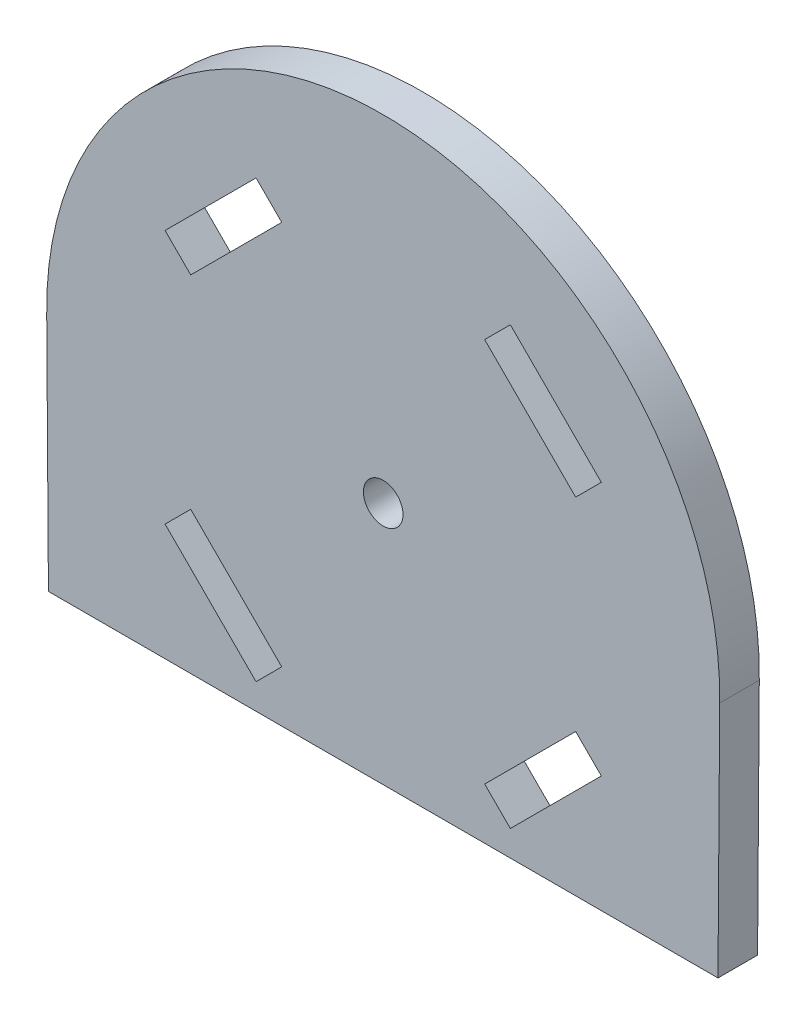
ISO-10303-21;
HEADER;
FILE_DESCRIPTION(('STEP AP214'),'2;1');
FILE_NAME('part.step','',(''),(''),'','','');
FILE_SCHEMA(('AUTOMOTIVE_DESIGN { 1 0 10303 214 1 1 1 1 }'));
ENDSEC;
DATA;
#1=APPLICATION_CONTEXT('core data for automotive mechanical design processes');
#2=APPLICATION_PROTOCOL_DEFINITION('international standard','automotive_design',2000,#1);
#3=PRODUCT_CONTEXT('',#1,'mechanical');
#4=PRODUCT('Part','Part','',(#3));
#5=PRODUCT_RELATED_PRODUCT_CATEGORY('part','',(#4));
#6=PRODUCT_DEFINITION_FORMATION('','',#4);
#7=PRODUCT_DEFINITION_CONTEXT('part definition',#1,'design');
#8=PRODUCT_DEFINITION('design','',#6,#7);
#9=PRODUCT_DEFINITION_SHAPE('','',#8);
#10=(LENGTH_UNIT() NAMED_UNIT(*) SI_UNIT(.MILLI.,.METRE.));
#11=(NAMED_UNIT(*) PLANE_ANGLE_UNIT() SI_UNIT($,.RADIAN.));
#12=(NAMED_UNIT(*) SI_UNIT($,.STERADIAN.) SOLID_ANGLE_UNIT());
#13=UNCERTAINTY_MEASURE_WITH_UNIT(LENGTH_MEASURE(1.E-05),#10,'distance_accuracy_value','');
#14=(GEOMETRIC_REPRESENTATION_CONTEXT(3) GLOBAL_UNCERTAINTY_ASSIGNED_CONTEXT((#13)) GLOBAL_UNIT_ASSIGNED_CONTEXT((#10,
#11,#12)) REPRESENTATION_CONTEXT('',''));
#15=CARTESIAN_POINT('',(0.,0.,0.));
#16=DIRECTION('',(0.,0.,1.));
#17=DIRECTION('',(1.,0.,0.));
#18=AXIS2_PLACEMENT_3D('',#15,#16,#17);
#19=CARTESIAN_POINT('',(72.0767167999961,45.7353085439818,6.));
#20=DIRECTION('',(0.,0.,1.));
#21=DIRECTION('',(1.,0.,0.));
#22=AXIS2_PLACEMENT_3D('',#19,#20,#21);
#23=PLANE('',#22);
#24=DIRECTION('',(-0.707106781186547,0.707106781186548,0.));
#25=VECTOR('',#24,1.);
#26=CARTESIAN_POINT('',(91.3453765873305,12.6780665235102,6.));
#27=LINE('',#26,#25);
#28=CARTESIAN_POINT('',(91.3453765873305,12.6780665235102,6.));
#29=VERTEX_POINT('',#28);
#30=CARTESIAN_POINT('',(87.4562892908038,16.5671538200368,6.));
#31=VERTEX_POINT('',#30);
#32=EDGE_CURVE('E349',#29,#31,#27,.T.);
#33=ORIENTED_EDGE('',*,*,#32,.T.);
#34=DIRECTION('',(0.707106781186594,0.707106781186501,0.));
#35=VECTOR('',#34,1.);
#36=CARTESIAN_POINT('',(87.4562892908038,16.5671538200368,6.));
#37=LINE('',#36,#35);
#38=CARTESIAN_POINT('',(101.244871523942,30.3557360531741,6.));
#39=VERTEX_POINT('',#38);
#40=EDGE_CURVE('E353',#31,#39,#37,.T.);
#41=ORIENTED_EDGE('',*,*,#40,.T.);
#42=DIRECTION('',(0.707106781186548,-0.707106781186547,0.));
#43=VECTOR('',#42,1.);
#44=CARTESIAN_POINT('',(101.244871523942,30.3557360531741,6.));
#45=LINE('',#44,#43);
#46=CARTESIAN_POINT('',(105.133958820468,26.4666487566483,6.));
#47=VERTEX_POINT('',#46);
#48=EDGE_CURVE('E358',#39,#47,#45,.T.);
#49=ORIENTED_EDGE('',*,*,#48,.T.);
#50=DIRECTION('',(-0.707106781186524,-0.707106781186571,0.));
#51=VECTOR('',#50,1.);
#52=CARTESIAN_POINT('',(105.133958820468,26.4666487566483,6.));
#53=LINE('',#52,#51);
#54=EDGE_CURVE('E362',#47,#29,#53,.T.);
#55=ORIENTED_EDGE('',*,*,#54,.T.);
#56=EDGE_LOOP('',(#33,#41,#49,#55));
#57=FACE_BOUND('',#56,.T.);
#58=DIRECTION('',(-1.,0.,0.));
#59=VECTOR('',#58,1.);
#60=CARTESIAN_POINT('',(122.811628350131,8.7889792269844,6.));
#61=LINE('',#60,#59);
#62=CARTESIAN_POINT('',(122.811628350131,8.7889792269844,6.));
#63=VERTEX_POINT('',#62);
#64=CARTESIAN_POINT('',(21.3418052498596,8.78897922698622,6.));
#65=VERTEX_POINT('',#64);
#66=EDGE_CURVE('E486',#63,#65,#61,.T.);
#67=ORIENTED_EDGE('',*,*,#66,.F.);
#68=DIRECTION('',(0.00717477572590252,0.999974260965392,0.));
#69=VECTOR('',#68,1.);
#70=CARTESIAN_POINT('',(122.811628350131,8.7889792269844,6.));
#71=LINE('',#70,#69);
#72=CARTESIAN_POINT('',(123.071466104511,45.0035002564423,6.));
#73=VERTEX_POINT('',#72);
#74=EDGE_CURVE('E498',#63,#73,#71,.T.);
#75=ORIENTED_EDGE('',*,*,#74,.T.);
#76=CARTESIAN_POINT('',(72.0767167999961,45.7353085439818,6.));
#77=DIRECTION('',(0.,0.,1.));
#78=DIRECTION('',(1.,0.,0.));
#79=AXIS2_PLACEMENT_3D('',#76,#77,#78);
#80=CIRCLE('',#79,51.0000000000005);
#81=CARTESIAN_POINT('',(21.0819674954824,45.0035002563497,6.));
#82=VERTEX_POINT('',#81);
#83=EDGE_CURVE('E495',#73,#82,#80,.T.);
#84=ORIENTED_EDGE('',*,*,#83,.T.);
#85=DIRECTION('',(-0.00717477572583473,0.999974260965393,0.));
#86=VECTOR('',#85,1.);
#87=CARTESIAN_POINT('',(21.3418052498596,8.78897922698622,6.));
#88=LINE('',#87,#86);
#89=EDGE_CURVE('E490',#65,#82,#88,.T.);
#90=ORIENTED_EDGE('',*,*,#89,.F.);
#91=EDGE_LOOP('',(#67,#75,#84,#90));
#92=FACE_BOUND('',#91,.T.);
#93=DIRECTION('',(0.707106781186713,0.707106781186382,0.));
#94=VECTOR('',#93,1.);
#95=CARTESIAN_POINT('',(39.0194747795244,26.4666487566483,6.));
#96=LINE('',#95,#94);
#97=CARTESIAN_POINT('',(39.0194747795244,26.4666487566483,6.));
#98=VERTEX_POINT('',#97);
#99=CARTESIAN_POINT('',(42.908562076052,30.3557360531741,6.));
#100=VERTEX_POINT('',#99);
#101=EDGE_CURVE('E455',#98,#100,#96,.T.);
#102=ORIENTED_EDGE('',*,*,#101,.T.);
#103=DIRECTION('',(0.707106781186547,-0.707106781186548,0.));
#104=VECTOR('',#103,1.);
#105=CARTESIAN_POINT('',(42.908562076052,30.3557360531741,6.));
#106=LINE('',#105,#104);
#107=CARTESIAN_POINT('',(56.6971443091893,16.5671538200368,6.));
#108=VERTEX_POINT('',#107);
#109=EDGE_CURVE('E442',#100,#108,#106,.T.);
#110=ORIENTED_EDGE('',*,*,#109,.T.);
#111=DIRECTION('',(-0.707106781186465,-0.707106781186631,0.));
#112=VECTOR('',#111,1.);
#113=CARTESIAN_POINT('',(56.6971443091893,16.5671538200368,6.));
#114=LINE('',#113,#112);
#115=CARTESIAN_POINT('',(52.8080570126635,12.6780665235102,6.));
#116=VERTEX_POINT('',#115);
#117=EDGE_CURVE('E446',#108,#116,#114,.T.);
#118=ORIENTED_EDGE('',*,*,#117,.T.);
#119=DIRECTION('',(-0.707106781186571,0.707106781186524,0.));
#120=VECTOR('',#119,1.);
#121=CARTESIAN_POINT('',(52.8080570126635,12.6780665235102,6.));
#122=LINE('',#121,#120);
#123=EDGE_CURVE('E451',#116,#98,#122,.T.);
#124=ORIENTED_EDGE('',*,*,#123,.T.);
#125=EDGE_LOOP('',(#102,#110,#118,#124));
#126=FACE_BOUND('',#125,.T.);
#127=CARTESIAN_POINT('',(72.0767167999961,45.7353085439818,6.));
#128=DIRECTION('',(0.,0.,1.));
#129=DIRECTION('',(1.,0.,0.));
#130=AXIS2_PLACEMENT_3D('',#127,#128,#129);
#131=CIRCLE('',#130,3.);
#132=CARTESIAN_POINT('',(75.0767167999961,45.7353085439818,6.));
#133=VERTEX_POINT('',#132);
#134=EDGE_CURVE('E434',#133,#133,#131,.T.);
#135=ORIENTED_EDGE('',*,*,#134,.F.);
#136=EDGE_LOOP('',(#135));
#137=FACE_BOUND('',#136,.T.);
#138=DIRECTION('',(-0.707106781186547,0.707106781186548,0.));
#139=VECTOR('',#138,1.);
#140=CARTESIAN_POINT('',(56.6971443091893,74.9034632679268,6.));
#141=LINE('',#140,#139);
#142=CARTESIAN_POINT('',(56.6971443091893,74.9034632679268,6.));
#143=VERTEX_POINT('',#142);
#144=CARTESIAN_POINT('',(52.8080570126635,78.7925505644526,6.));
#145=VERTEX_POINT('',#144);
#146=EDGE_CURVE('E396',#143,#145,#141,.T.);
#147=ORIENTED_EDGE('',*,*,#146,.F.);
#148=DIRECTION('',(0.707106781186501,0.707106781186594,0.));
#149=VECTOR('',#148,1.);
#150=CARTESIAN_POINT('',(42.908562076052,61.1148810347887,6.));
#151=LINE('',#150,#149);
#152=CARTESIAN_POINT('',(42.908562076052,61.1148810347887,6.));
#153=VERTEX_POINT('',#152);
#154=EDGE_CURVE('E393',#153,#143,#151,.T.);
#155=ORIENTED_EDGE('',*,*,#154,.F.);
#156=DIRECTION('',(0.707106781186549,-0.707106781186546,0.));
#157=VECTOR('',#156,1.);
#158=CARTESIAN_POINT('',(39.0194747795253,65.0039683313153,6.));
#159=LINE('',#158,#157);
#160=CARTESIAN_POINT('',(39.0194747795253,65.0039683313153,6.));
#161=VERTEX_POINT('',#160);
#162=EDGE_CURVE('E404',#161,#153,#159,.T.);
#163=ORIENTED_EDGE('',*,*,#162,.F.);
#164=DIRECTION('',(-0.707106781186571,-0.707106781186524,0.));
#165=VECTOR('',#164,1.);
#166=CARTESIAN_POINT('',(52.8080570126635,78.7925505644526,6.));
#167=LINE('',#166,#165);
#168=EDGE_CURVE('E400',#145,#161,#167,.T.);
#169=ORIENTED_EDGE('',*,*,#168,.F.);
#170=EDGE_LOOP('',(#147,#155,#163,#169));
#171=FACE_BOUND('',#170,.T.);
#172=DIRECTION('',(0.707106781186466,0.707106781186629,0.));
#173=VECTOR('',#172,1.);
#174=CARTESIAN_POINT('',(101.244871523942,61.1148810347887,6.));
#175=LINE('',#174,#173);
#176=CARTESIAN_POINT('',(101.244871523942,61.1148810347887,6.));
#177=VERTEX_POINT('',#176);
#178=CARTESIAN_POINT('',(105.133958820468,65.0039683313153,6.));
#179=VERTEX_POINT('',#178);
#180=EDGE_CURVE('E308',#177,#179,#175,.T.);
#181=ORIENTED_EDGE('',*,*,#180,.F.);
#182=DIRECTION('',(0.707106781186594,-0.707106781186501,0.));
#183=VECTOR('',#182,1.);
#184=CARTESIAN_POINT('',(87.4562892908029,74.9034632679268,6.));
#185=LINE('',#184,#183);
#186=CARTESIAN_POINT('',(87.4562892908029,74.9034632679268,6.));
#187=VERTEX_POINT('',#186);
#188=EDGE_CURVE('E299',#187,#177,#185,.T.);
#189=ORIENTED_EDGE('',*,*,#188,.F.);
#190=DIRECTION('',(-0.707106781186713,-0.707106781186382,0.));
#191=VECTOR('',#190,1.);
#192=CARTESIAN_POINT('',(91.3453765873305,78.7925505644526,6.));
#193=LINE('',#192,#191);
#194=CARTESIAN_POINT('',(91.3453765873305,78.7925505644526,6.));
#195=VERTEX_POINT('',#194);
#196=EDGE_CURVE('E326',#195,#187,#193,.T.);
#197=ORIENTED_EDGE('',*,*,#196,.F.);
#198=DIRECTION('',(-0.707106781186547,0.707106781186547,0.));
#199=VECTOR('',#198,1.);
#200=CARTESIAN_POINT('',(105.133958820468,65.0039683313153,6.));
#201=LINE('',#200,#199);
#202=EDGE_CURVE('E322',#179,#195,#201,.T.);
#203=ORIENTED_EDGE('',*,*,#202,.F.);
#204=EDGE_LOOP('',(#181,#189,#197,#203));
#205=FACE_BOUND('',#204,.T.);
#206=ADVANCED_FACE('F162',(#57,#92,#126,#137,#171,#205),#23,.T.);
#207=CARTESIAN_POINT('',(72.0767167999961,45.7353085439818,0.));
#208=DIRECTION('',(0.,0.,1.));
#209=DIRECTION('',(1.,0.,0.));
#210=AXIS2_PLACEMENT_3D('',#207,#208,#209);
#211=PLANE('',#210);
#212=DIRECTION('',(0.707106781186547,0.707106781186547,0.));
#213=VECTOR('',#212,1.);
#214=CARTESIAN_POINT('',(49.8028531926206,68.0091721513582,0.));
#215=LINE('',#214,#213);
#216=CARTESIAN_POINT('',(42.908562076052,61.1148810347887,0.));
#217=VERTEX_POINT('',#216);
#218=CARTESIAN_POINT('',(56.6971443091893,74.9034632679268,0.));
#219=VERTEX_POINT('',#218);
#220=EDGE_CURVE('E383',#217,#219,#215,.T.);
#221=ORIENTED_EDGE('',*,*,#220,.T.);
#222=DIRECTION('',(-0.707106781186547,0.707106781186548,0.));
#223=VECTOR('',#222,1.);
#224=CARTESIAN_POINT('',(56.6971443091893,74.9034632679268,0.));
#225=LINE('',#224,#223);
#226=CARTESIAN_POINT('',(52.8080570126635,78.7925505644526,0.));
#227=VERTEX_POINT('',#226);
#228=EDGE_CURVE('E411',#219,#227,#225,.T.);
#229=ORIENTED_EDGE('',*,*,#228,.T.);
#230=DIRECTION('',(-0.707106781186571,-0.707106781186524,0.));
#231=VECTOR('',#230,1.);
#232=CARTESIAN_POINT('',(52.8080570126635,78.7925505644526,0.));
#233=LINE('',#232,#231);
#234=CARTESIAN_POINT('',(39.0194747795253,65.0039683313153,0.));
#235=VERTEX_POINT('',#234);
#236=EDGE_CURVE('E415',#227,#235,#233,.T.);
#237=ORIENTED_EDGE('',*,*,#236,.T.);
#238=DIRECTION('',(0.707106781186549,-0.707106781186546,0.));
#239=VECTOR('',#238,1.);
#240=CARTESIAN_POINT('',(39.0194747795253,65.0039683313153,0.));
#241=LINE('',#240,#239);
#242=EDGE_CURVE('E397',#235,#217,#241,.T.);
#243=ORIENTED_EDGE('',*,*,#242,.T.);
#244=EDGE_LOOP('',(#221,#229,#237,#243));
#245=FACE_BOUND('',#244,.T.);
#246=DIRECTION('',(0.707106781186547,-0.707106781186547,0.));
#247=VECTOR('',#246,1.);
#248=CARTESIAN_POINT('',(49.8028531926206,23.4614449366055,0.));
#249=LINE('',#248,#247);
#250=CARTESIAN_POINT('',(42.908562076052,30.3557360531741,0.));
#251=VERTEX_POINT('',#250);
#252=CARTESIAN_POINT('',(56.6971443091893,16.5671538200368,0.));
#253=VERTEX_POINT('',#252);
#254=EDGE_CURVE('E438',#251,#253,#249,.T.);
#255=ORIENTED_EDGE('',*,*,#254,.F.);
#256=DIRECTION('',(0.707106781186713,0.707106781186382,0.));
#257=VECTOR('',#256,1.);
#258=CARTESIAN_POINT('',(39.0194747795244,26.4666487566483,0.));
#259=LINE('',#258,#257);
#260=CARTESIAN_POINT('',(39.0194747795244,26.4666487566483,0.));
#261=VERTEX_POINT('',#260);
#262=EDGE_CURVE('E447',#261,#251,#259,.T.);
#263=ORIENTED_EDGE('',*,*,#262,.F.);
#264=DIRECTION('',(-0.707106781186571,0.707106781186524,0.));
#265=VECTOR('',#264,1.);
#266=CARTESIAN_POINT('',(52.8080570126635,12.6780665235102,0.));
#267=LINE('',#266,#265);
#268=CARTESIAN_POINT('',(52.8080570126635,12.6780665235102,0.));
#269=VERTEX_POINT('',#268);
#270=EDGE_CURVE('E467',#269,#261,#267,.T.);
#271=ORIENTED_EDGE('',*,*,#270,.F.);
#272=DIRECTION('',(-0.707106781186465,-0.707106781186631,0.));
#273=VECTOR('',#272,1.);
#274=CARTESIAN_POINT('',(56.6971443091893,16.5671538200368,0.));
#275=LINE('',#274,#273);
#276=EDGE_CURVE('E463',#253,#269,#275,.T.);
#277=ORIENTED_EDGE('',*,*,#276,.F.);
#278=EDGE_LOOP('',(#255,#263,#271,#277));
#279=FACE_BOUND('',#278,.T.);
#280=DIRECTION('',(-1.,0.,0.));
#281=VECTOR('',#280,1.);
#282=CARTESIAN_POINT('',(122.811628350131,8.7889792269844,0.));
#283=LINE('',#282,#281);
#284=CARTESIAN_POINT('',(122.811628350131,8.7889792269844,0.));
#285=VERTEX_POINT('',#284);
#286=CARTESIAN_POINT('',(21.3418052498596,8.78897922698622,0.));
#287=VERTEX_POINT('',#286);
#288=EDGE_CURVE('E477',#285,#287,#283,.T.);
#289=ORIENTED_EDGE('',*,*,#288,.T.);
#290=DIRECTION('',(-0.00717477572583473,0.999974260965393,0.));
#291=VECTOR('',#290,1.);
#292=CARTESIAN_POINT('',(21.3418052498596,8.78897922698622,0.));
#293=LINE('',#292,#291);
#294=CARTESIAN_POINT('',(21.0819674954824,45.0035002563497,0.));
#295=VERTEX_POINT('',#294);
#296=EDGE_CURVE('E504',#287,#295,#293,.T.);
#297=ORIENTED_EDGE('',*,*,#296,.T.);
#298=CARTESIAN_POINT('',(72.0767167999961,45.7353085439818,0.));
#299=DIRECTION('',(0.,0.,1.));
#300=DIRECTION('',(1.,0.,0.));
#301=AXIS2_PLACEMENT_3D('',#298,#299,#300);
#302=CIRCLE('',#301,51.0000000000005);
#303=CARTESIAN_POINT('',(123.071466104511,45.0035002564423,0.));
#304=VERTEX_POINT('',#303);
#305=EDGE_CURVE('E508',#304,#295,#302,.T.);
#306=ORIENTED_EDGE('',*,*,#305,.F.);
#307=DIRECTION('',(0.00717477572590252,0.999974260965392,0.));
#308=VECTOR('',#307,1.);
#309=CARTESIAN_POINT('',(122.811628350131,8.7889792269844,0.));
#310=LINE('',#309,#308);
#311=EDGE_CURVE('E491',#285,#304,#310,.T.);
#312=ORIENTED_EDGE('',*,*,#311,.F.);
#313=EDGE_LOOP('',(#289,#297,#306,#312));
#314=FACE_BOUND('',#313,.T.);
#315=CARTESIAN_POINT('',(72.0767167999961,45.7353085439818,0.));
#316=DIRECTION('',(0.,0.,1.));
#317=DIRECTION('',(1.,0.,0.));
#318=AXIS2_PLACEMENT_3D('',#315,#316,#317);
#319=CIRCLE('',#318,3.);
#320=CARTESIAN_POINT('',(75.0767167999961,45.7353085439818,0.));
#321=VERTEX_POINT('',#320);
#322=EDGE_CURVE('E433',#321,#321,#319,.T.);
#323=ORIENTED_EDGE('',*,*,#322,.T.);
#324=EDGE_LOOP('',(#323));
#325=FACE_BOUND('',#324,.T.);
#326=DIRECTION('',(0.707106781186548,0.707106781186547,0.));
#327=VECTOR('',#326,1.);
#328=CARTESIAN_POINT('',(94.3505804073734,23.4614449366055,0.));
#329=LINE('',#328,#327);
#330=CARTESIAN_POINT('',(87.4562892908047,16.5671538200368,0.));
#331=VERTEX_POINT('',#330);
#332=CARTESIAN_POINT('',(101.244871523942,30.3557360531741,0.));
#333=VERTEX_POINT('',#332);
#334=EDGE_CURVE('E369',#331,#333,#329,.T.);
#335=ORIENTED_EDGE('',*,*,#334,.F.);
#336=DIRECTION('',(-0.707106781186547,0.707106781186548,0.));
#337=VECTOR('',#336,1.);
#338=CARTESIAN_POINT('',(91.3453765873305,12.6780665235102,0.));
#339=LINE('',#338,#337);
#340=CARTESIAN_POINT('',(91.3453765873305,12.6780665235102,0.));
#341=VERTEX_POINT('',#340);
#342=EDGE_CURVE('E318',#341,#331,#339,.T.);
#343=ORIENTED_EDGE('',*,*,#342,.F.);
#344=DIRECTION('',(-0.707106781186524,-0.707106781186571,0.));
#345=VECTOR('',#344,1.);
#346=CARTESIAN_POINT('',(105.133958820468,26.4666487566483,0.));
#347=LINE('',#346,#345);
#348=CARTESIAN_POINT('',(105.133958820468,26.4666487566483,0.));
#349=VERTEX_POINT('',#348);
#350=EDGE_CURVE('E354',#349,#341,#347,.T.);
#351=ORIENTED_EDGE('',*,*,#350,.F.);
#352=DIRECTION('',(0.707106781186548,-0.707106781186547,0.));
#353=VECTOR('',#352,1.);
#354=CARTESIAN_POINT('',(101.244871523942,30.3557360531741,0.));
#355=LINE('',#354,#353);
#356=EDGE_CURVE('E373',#333,#349,#355,.T.);
#357=ORIENTED_EDGE('',*,*,#356,.F.);
#358=EDGE_LOOP('',(#335,#343,#351,#357));
#359=FACE_BOUND('',#358,.T.);
#360=DIRECTION('',(0.707106781186549,-0.707106781186546,0.));
#361=VECTOR('',#360,1.);
#362=CARTESIAN_POINT('',(94.3505804073725,68.0091721513582,0.));
#363=LINE('',#362,#361);
#364=CARTESIAN_POINT('',(87.4562892908029,74.9034632679268,0.));
#365=VERTEX_POINT('',#364);
#366=CARTESIAN_POINT('',(101.244871523942,61.1148810347887,0.));
#367=VERTEX_POINT('',#366);
#368=EDGE_CURVE('E331',#365,#367,#363,.T.);
#369=ORIENTED_EDGE('',*,*,#368,.T.);
#370=DIRECTION('',(0.707106781186466,0.707106781186629,0.));
#371=VECTOR('',#370,1.);
#372=CARTESIAN_POINT('',(101.244871523942,61.1148810347887,0.));
#373=LINE('',#372,#371);
#374=CARTESIAN_POINT('',(105.133958820468,65.0039683313153,0.));
#375=VERTEX_POINT('',#374);
#376=EDGE_CURVE('E315',#367,#375,#373,.T.);
#377=ORIENTED_EDGE('',*,*,#376,.T.);
#378=DIRECTION('',(-0.707106781186547,0.707106781186547,0.));
#379=VECTOR('',#378,1.);
#380=CARTESIAN_POINT('',(105.133958820468,65.0039683313153,0.));
#381=LINE('',#380,#379);
#382=CARTESIAN_POINT('',(91.3453765873305,78.7925505644526,0.));
#383=VERTEX_POINT('',#382);
#384=EDGE_CURVE('E336',#375,#383,#381,.T.);
#385=ORIENTED_EDGE('',*,*,#384,.T.);
#386=DIRECTION('',(-0.707106781186713,-0.707106781186382,0.));
#387=VECTOR('',#386,1.);
#388=CARTESIAN_POINT('',(91.3453765873305,78.7925505644526,0.));
#389=LINE('',#388,#387);
#390=EDGE_CURVE('E309',#383,#365,#389,.T.);
#391=ORIENTED_EDGE('',*,*,#390,.T.);
#392=EDGE_LOOP('',(#369,#377,#385,#391));
#393=FACE_BOUND('',#392,.T.);
#394=ADVANCED_FACE('F530',(#245,#279,#314,#325,#359,#393),#211,.F.);
#395=CARTESIAN_POINT('',(122.811628350131,8.7889792269844,6.));
#396=DIRECTION('',(0.,-1.,0.));
#397=DIRECTION('',(1.,0.,0.));
#398=AXIS2_PLACEMENT_3D('',#395,#396,#397);
#399=PLANE('',#398);
#400=ORIENTED_EDGE('',*,*,#288,.F.);
#401=DIRECTION('',(0.,0.,-1.));
#402=VECTOR('',#401,1.);
#403=CARTESIAN_POINT('',(122.811628350131,8.7889792269844,6.));
#404=LINE('',#403,#402);
#405=EDGE_CURVE('E12',#63,#285,#404,.T.);
#406=ORIENTED_EDGE('',*,*,#405,.F.);
#407=ORIENTED_EDGE('',*,*,#66,.T.);
#408=DIRECTION('',(0.,0.,-1.));
#409=VECTOR('',#408,1.);
#410=CARTESIAN_POINT('',(21.3418052498596,8.78897922698622,6.));
#411=LINE('',#410,#409);
#412=EDGE_CURVE('E166',#65,#287,#411,.T.);
#413=ORIENTED_EDGE('',*,*,#412,.T.);
#414=EDGE_LOOP('',(#400,#406,#407,#413));
#415=FACE_BOUND('',#414,.T.);
#416=ADVANCED_FACE('F164',(#415),#399,.T.);
#417=CARTESIAN_POINT('',(122.811628350131,8.7889792269844,6.));
#418=DIRECTION('',(-0.999974260965392,0.00717477572590251,0.));
#419=DIRECTION('',(-0.00717477572590252,-0.999974260965393,0.));
#420=AXIS2_PLACEMENT_3D('',#417,#418,#419);
#421=PLANE('',#420);
#422=ORIENTED_EDGE('',*,*,#311,.T.);
#423=DIRECTION('',(0.,0.,-1.));
#424=VECTOR('',#423,1.);
#425=CARTESIAN_POINT('',(123.071466104511,45.0035002564423,6.));
#426=LINE('',#425,#424);
#427=EDGE_CURVE('E172',#73,#304,#426,.T.);
#428=ORIENTED_EDGE('',*,*,#427,.F.);
#429=ORIENTED_EDGE('',*,*,#74,.F.);
#430=ORIENTED_EDGE('',*,*,#405,.T.);
#431=EDGE_LOOP('',(#422,#428,#429,#430));
#432=FACE_BOUND('',#431,.T.);
#433=ADVANCED_FACE('F534',(#432),#421,.F.);
#434=CARTESIAN_POINT('',(72.0767167999961,45.7353085439818,6.));
#435=DIRECTION('',(0.,0.,-1.));
#436=DIRECTION('',(-1.,0.,0.));
#437=AXIS2_PLACEMENT_3D('',#434,#435,#436);
#438=CYLINDRICAL_SURFACE('',#437,51.0000000000005);
#439=ORIENTED_EDGE('',*,*,#305,.T.);
#440=DIRECTION('',(0.,0.,-1.));
#441=VECTOR('',#440,1.);
#442=CARTESIAN_POINT('',(21.0819674954824,45.0035002563497,6.));
#443=LINE('',#442,#441);
#444=EDGE_CURVE('E516',#82,#295,#443,.T.);
#445=ORIENTED_EDGE('',*,*,#444,.F.);
#446=ORIENTED_EDGE('',*,*,#83,.F.);
#447=ORIENTED_EDGE('',*,*,#427,.T.);
#448=EDGE_LOOP('',(#439,#445,#446,#447));
#449=FACE_BOUND('',#448,.T.);
#450=ADVANCED_FACE('F538',(#449),#438,.T.);
#451=CARTESIAN_POINT('',(21.3418052498596,8.78897922698622,6.));
#452=DIRECTION('',(-0.999974260965393,-0.00717477572583473,0.));
#453=DIRECTION('',(0.00717477572583473,-0.999974260965393,0.));
#454=AXIS2_PLACEMENT_3D('',#451,#452,#453);
#455=PLANE('',#454);
#456=ORIENTED_EDGE('',*,*,#296,.F.);
#457=ORIENTED_EDGE('',*,*,#412,.F.);
#458=ORIENTED_EDGE('',*,*,#89,.T.);
#459=ORIENTED_EDGE('',*,*,#444,.T.);
#460=EDGE_LOOP('',(#456,#457,#458,#459));
#461=FACE_BOUND('',#460,.T.);
#462=ADVANCED_FACE('F526',(#461),#455,.T.);
#463=CARTESIAN_POINT('',(39.0194747795244,26.4666487566483,6.));
#464=DIRECTION('',(-0.707106781186382,0.707106781186713,0.));
#465=DIRECTION('',(-0.707106781186713,-0.707106781186382,0.));
#466=AXIS2_PLACEMENT_3D('',#463,#464,#465);
#467=PLANE('',#466);
#468=ORIENTED_EDGE('',*,*,#262,.T.);
#469=DIRECTION('',(0.,0.,-1.));
#470=VECTOR('',#469,1.);
#471=CARTESIAN_POINT('',(42.908562076052,30.3557360531741,6.));
#472=LINE('',#471,#470);
#473=EDGE_CURVE('E473',#100,#251,#472,.T.);
#474=ORIENTED_EDGE('',*,*,#473,.F.);
#475=ORIENTED_EDGE('',*,*,#101,.F.);
#476=DIRECTION('',(0.,0.,-1.));
#477=VECTOR('',#476,1.);
#478=CARTESIAN_POINT('',(39.0194747795244,26.4666487566483,6.));
#479=LINE('',#478,#477);
#480=EDGE_CURVE('E478',#98,#261,#479,.T.);
#481=ORIENTED_EDGE('',*,*,#480,.T.);
#482=EDGE_LOOP('',(#468,#474,#475,#481));
#483=FACE_BOUND('',#482,.T.);
#484=ADVANCED_FACE('F591',(#483),#467,.F.);
#485=CARTESIAN_POINT('',(52.8080570126635,12.6780665235102,6.));
#486=DIRECTION('',(-0.707106781186524,-0.707106781186571,0.));
#487=DIRECTION('',(0.707106781186571,-0.707106781186524,0.));
#488=AXIS2_PLACEMENT_3D('',#485,#486,#487);
#489=PLANE('',#488);
#490=ORIENTED_EDGE('',*,*,#270,.T.);
#491=ORIENTED_EDGE('',*,*,#480,.F.);
#492=ORIENTED_EDGE('',*,*,#123,.F.);
#493=DIRECTION('',(0.,0.,-1.));
#494=VECTOR('',#493,1.);
#495=CARTESIAN_POINT('',(52.8080570126635,12.6780665235102,6.));
#496=LINE('',#495,#494);
#497=EDGE_CURVE('E481',#116,#269,#496,.T.);
#498=ORIENTED_EDGE('',*,*,#497,.T.);
#499=EDGE_LOOP('',(#490,#491,#492,#498));
#500=FACE_BOUND('',#499,.T.);
#501=ADVANCED_FACE('F594',(#500),#489,.F.);
#502=CARTESIAN_POINT('',(56.6971443091893,16.5671538200368,6.));
#503=DIRECTION('',(0.70710678118663,-0.707106781186465,0.));
#504=DIRECTION('',(0.707106781186465,0.70710678118663,0.));
#505=AXIS2_PLACEMENT_3D('',#502,#503,#504);
#506=PLANE('',#505);
#507=ORIENTED_EDGE('',*,*,#276,.T.);
#508=ORIENTED_EDGE('',*,*,#497,.F.);
#509=ORIENTED_EDGE('',*,*,#117,.F.);
#510=DIRECTION('',(0.,0.,-1.));
#511=VECTOR('',#510,1.);
#512=CARTESIAN_POINT('',(56.6971443091893,16.5671538200368,6.));
#513=LINE('',#512,#511);
#514=EDGE_CURVE('E459',#108,#253,#513,.T.);
#515=ORIENTED_EDGE('',*,*,#514,.T.);
#516=EDGE_LOOP('',(#507,#508,#509,#515));
#517=FACE_BOUND('',#516,.T.);
#518=ADVANCED_FACE('F598',(#517),#506,.F.);
#519=CARTESIAN_POINT('',(49.8028531926206,23.4614449366055,6.));
#520=DIRECTION('',(0.707106781186548,0.707106781186548,0.));
#521=DIRECTION('',(-0.707106781186548,0.707106781186548,0.));
#522=AXIS2_PLACEMENT_3D('',#519,#520,#521);
#523=PLANE('',#522);
#524=ORIENTED_EDGE('',*,*,#254,.T.);
#525=ORIENTED_EDGE('',*,*,#514,.F.);
#526=ORIENTED_EDGE('',*,*,#109,.F.);
#527=ORIENTED_EDGE('',*,*,#473,.T.);
#528=EDGE_LOOP('',(#524,#525,#526,#527));
#529=FACE_BOUND('',#528,.T.);
#530=ADVANCED_FACE('F589',(#529),#523,.F.);
#531=CARTESIAN_POINT('',(72.0767167999961,45.7353085439818,6.));
#532=DIRECTION('',(0.,0.,-1.));
#533=DIRECTION('',(-1.,0.,0.));
#534=AXIS2_PLACEMENT_3D('',#531,#532,#533);
#535=CYLINDRICAL_SURFACE('',#534,3.);
#536=ORIENTED_EDGE('',*,*,#134,.T.);
#537=EDGE_LOOP('',(#536));
#538=FACE_BOUND('',#537,.T.);
#539=ORIENTED_EDGE('',*,*,#322,.F.);
#540=EDGE_LOOP('',(#539));
#541=FACE_BOUND('',#540,.T.);
#542=ADVANCED_FACE('F586',(#538,#541),#535,.F.);
#543=CARTESIAN_POINT('',(49.8028531926206,68.0091721513582,6.));
#544=DIRECTION('',(-0.707106781186548,0.707106781186548,0.));
#545=DIRECTION('',(-0.707106781186548,-0.707106781186548,0.));
#546=AXIS2_PLACEMENT_3D('',#543,#544,#545);
#547=PLANE('',#546);
#548=ORIENTED_EDGE('',*,*,#220,.F.);
#549=DIRECTION('',(0.,0.,-1.));
#550=VECTOR('',#549,1.);
#551=CARTESIAN_POINT('',(42.908562076052,61.1148810347887,6.));
#552=LINE('',#551,#550);
#553=EDGE_CURVE('E407',#153,#217,#552,.T.);
#554=ORIENTED_EDGE('',*,*,#553,.F.);
#555=ORIENTED_EDGE('',*,*,#154,.T.);
#556=DIRECTION('',(0.,0.,-1.));
#557=VECTOR('',#556,1.);
#558=CARTESIAN_POINT('',(56.6971443091893,74.9034632679268,6.));
#559=LINE('',#558,#557);
#560=EDGE_CURVE('E430',#143,#219,#559,.T.);
#561=ORIENTED_EDGE('',*,*,#560,.T.);
#562=EDGE_LOOP('',(#548,#554,#555,#561));
#563=FACE_BOUND('',#562,.T.);
#564=ADVANCED_FACE('F566',(#563),#547,.T.);
#565=CARTESIAN_POINT('',(56.6971443091893,74.9034632679268,6.));
#566=DIRECTION('',(-0.707106781186548,-0.707106781186547,0.));
#567=DIRECTION('',(0.707106781186547,-0.707106781186548,0.));
#568=AXIS2_PLACEMENT_3D('',#565,#566,#567);
#569=PLANE('',#568);
#570=ORIENTED_EDGE('',*,*,#228,.F.);
#571=ORIENTED_EDGE('',*,*,#560,.F.);
#572=ORIENTED_EDGE('',*,*,#146,.T.);
#573=DIRECTION('',(0.,0.,-1.));
#574=VECTOR('',#573,1.);
#575=CARTESIAN_POINT('',(52.8080570126635,78.7925505644526,6.));
#576=LINE('',#575,#574);
#577=EDGE_CURVE('E427',#145,#227,#576,.T.);
#578=ORIENTED_EDGE('',*,*,#577,.T.);
#579=EDGE_LOOP('',(#570,#571,#572,#578));
#580=FACE_BOUND('',#579,.T.);
#581=ADVANCED_FACE('F556',(#580),#569,.T.);
#582=CARTESIAN_POINT('',(52.8080570126635,78.7925505644526,6.));
#583=DIRECTION('',(0.707106781186524,-0.707106781186571,0.));
#584=DIRECTION('',(0.707106781186571,0.707106781186524,0.));
#585=AXIS2_PLACEMENT_3D('',#582,#583,#584);
#586=PLANE('',#585);
#587=ORIENTED_EDGE('',*,*,#236,.F.);
#588=ORIENTED_EDGE('',*,*,#577,.F.);
#589=ORIENTED_EDGE('',*,*,#168,.T.);
#590=DIRECTION('',(0.,0.,-1.));
#591=VECTOR('',#590,1.);
#592=CARTESIAN_POINT('',(39.0194747795253,65.0039683313153,6.));
#593=LINE('',#592,#591);
#594=EDGE_CURVE('E424',#161,#235,#593,.T.);
#595=ORIENTED_EDGE('',*,*,#594,.T.);
#596=EDGE_LOOP('',(#587,#588,#589,#595));
#597=FACE_BOUND('',#596,.T.);
#598=ADVANCED_FACE('F559',(#597),#586,.T.);
#599=CARTESIAN_POINT('',(39.0194747795253,65.0039683313153,6.));
#600=DIRECTION('',(0.707106781186546,0.707106781186549,0.));
#601=DIRECTION('',(-0.707106781186549,0.707106781186546,0.));
#602=AXIS2_PLACEMENT_3D('',#599,#600,#601);
#603=PLANE('',#602);
#604=ORIENTED_EDGE('',*,*,#242,.F.);
#605=ORIENTED_EDGE('',*,*,#594,.F.);
#606=ORIENTED_EDGE('',*,*,#162,.T.);
#607=ORIENTED_EDGE('',*,*,#553,.T.);
#608=EDGE_LOOP('',(#604,#605,#606,#607));
#609=FACE_BOUND('',#608,.T.);
#610=ADVANCED_FACE('F568',(#609),#603,.T.);
#611=CARTESIAN_POINT('',(91.3453765873305,12.6780665235102,6.));
#612=DIRECTION('',(-0.707106781186548,-0.707106781186547,0.));
#613=DIRECTION('',(0.707106781186547,-0.707106781186548,0.));
#614=AXIS2_PLACEMENT_3D('',#611,#612,#613);
#615=PLANE('',#614);
#616=ORIENTED_EDGE('',*,*,#342,.T.);
#617=DIRECTION('',(0.,0.,-1.));
#618=VECTOR('',#617,1.);
#619=CARTESIAN_POINT('',(87.4562892908038,16.5671538200368,6.));
#620=LINE('',#619,#618);
#621=EDGE_CURVE('E366',#31,#331,#620,.T.);
#622=ORIENTED_EDGE('',*,*,#621,.F.);
#623=ORIENTED_EDGE('',*,*,#32,.F.);
#624=DIRECTION('',(0.,0.,-1.));
#625=VECTOR('',#624,1.);
#626=CARTESIAN_POINT('',(91.3453765873305,12.6780665235102,6.));
#627=LINE('',#626,#625);
#628=EDGE_CURVE('E380',#29,#341,#627,.T.);
#629=ORIENTED_EDGE('',*,*,#628,.T.);
#630=EDGE_LOOP('',(#616,#622,#623,#629));
#631=FACE_BOUND('',#630,.T.);
#632=ADVANCED_FACE('F570',(#631),#615,.F.);
#633=CARTESIAN_POINT('',(105.133958820468,26.4666487566483,6.));
#634=DIRECTION('',(0.707106781186571,-0.707106781186524,0.));
#635=DIRECTION('',(0.707106781186524,0.707106781186571,0.));
#636=AXIS2_PLACEMENT_3D('',#633,#634,#635);
#637=PLANE('',#636);
#638=ORIENTED_EDGE('',*,*,#350,.T.);
#639=ORIENTED_EDGE('',*,*,#628,.F.);
#640=ORIENTED_EDGE('',*,*,#54,.F.);
#641=DIRECTION('',(0.,0.,-1.));
#642=VECTOR('',#641,1.);
#643=CARTESIAN_POINT('',(105.133958820468,26.4666487566483,6.));
#644=LINE('',#643,#642);
#645=EDGE_CURVE('E384',#47,#349,#644,.T.);
#646=ORIENTED_EDGE('',*,*,#645,.T.);
#647=EDGE_LOOP('',(#638,#639,#640,#646));
#648=FACE_BOUND('',#647,.T.);
#649=ADVANCED_FACE('F576',(#648),#637,.F.);
#650=CARTESIAN_POINT('',(101.244871523942,30.3557360531741,6.));
#651=DIRECTION('',(0.707106781186547,0.707106781186548,0.));
#652=DIRECTION('',(-0.707106781186548,0.707106781186547,0.));
#653=AXIS2_PLACEMENT_3D('',#650,#651,#652);
#654=PLANE('',#653);
#655=ORIENTED_EDGE('',*,*,#356,.T.);
#656=ORIENTED_EDGE('',*,*,#645,.F.);
#657=ORIENTED_EDGE('',*,*,#48,.F.);
#658=DIRECTION('',(0.,0.,-1.));
#659=VECTOR('',#658,1.);
#660=CARTESIAN_POINT('',(101.244871523942,30.3557360531741,6.));
#661=LINE('',#660,#659);
#662=EDGE_CURVE('E387',#39,#333,#661,.T.);
#663=ORIENTED_EDGE('',*,*,#662,.T.);
#664=EDGE_LOOP('',(#655,#656,#657,#663));
#665=FACE_BOUND('',#664,.T.);
#666=ADVANCED_FACE('F667',(#665),#654,.F.);
#667=CARTESIAN_POINT('',(94.3505804073734,23.4614449366055,6.));
#668=DIRECTION('',(-0.707106781186547,0.707106781186548,0.));
#669=DIRECTION('',(-0.707106781186548,-0.707106781186547,0.));
#670=AXIS2_PLACEMENT_3D('',#667,#668,#669);
#671=PLANE('',#670);
#672=ORIENTED_EDGE('',*,*,#334,.T.);
#673=ORIENTED_EDGE('',*,*,#662,.F.);
#674=ORIENTED_EDGE('',*,*,#40,.F.);
#675=ORIENTED_EDGE('',*,*,#621,.T.);
#676=EDGE_LOOP('',(#672,#673,#674,#675));
#677=FACE_BOUND('',#676,.T.);
#678=ADVANCED_FACE('F677',(#677),#671,.F.);
#679=CARTESIAN_POINT('',(94.3505804073725,68.0091721513582,6.));
#680=DIRECTION('',(0.707106781186546,0.707106781186548,0.));
#681=DIRECTION('',(-0.707106781186549,0.707106781186546,0.));
#682=AXIS2_PLACEMENT_3D('',#679,#680,#681);
#683=PLANE('',#682);
#684=ORIENTED_EDGE('',*,*,#368,.F.);
#685=DIRECTION('',(0.,0.,-1.));
#686=VECTOR('',#685,1.);
#687=CARTESIAN_POINT('',(87.4562892908029,74.9034632679268,6.));
#688=LINE('',#687,#686);
#689=EDGE_CURVE('E185',#187,#365,#688,.T.);
#690=ORIENTED_EDGE('',*,*,#689,.F.);
#691=ORIENTED_EDGE('',*,*,#188,.T.);
#692=DIRECTION('',(0.,0.,-1.));
#693=VECTOR('',#692,1.);
#694=CARTESIAN_POINT('',(101.244871523942,61.1148810347887,6.));
#695=LINE('',#694,#693);
#696=EDGE_CURVE('E302',#177,#367,#695,.T.);
#697=ORIENTED_EDGE('',*,*,#696,.T.);
#698=EDGE_LOOP('',(#684,#690,#691,#697));
#699=FACE_BOUND('',#698,.T.);
#700=ADVANCED_FACE('F301',(#699),#683,.T.);
#701=CARTESIAN_POINT('',(101.244871523942,61.1148810347887,6.));
#702=DIRECTION('',(-0.707106781186629,0.707106781186466,0.));
#703=DIRECTION('',(-0.707106781186466,-0.707106781186629,0.));
#704=AXIS2_PLACEMENT_3D('',#701,#702,#703);
#705=PLANE('',#704);
#706=ORIENTED_EDGE('',*,*,#376,.F.);
#707=ORIENTED_EDGE('',*,*,#696,.F.);
#708=ORIENTED_EDGE('',*,*,#180,.T.);
#709=DIRECTION('',(0.,0.,-1.));
#710=VECTOR('',#709,1.);
#711=CARTESIAN_POINT('',(105.133958820468,65.0039683313153,6.));
#712=LINE('',#711,#710);
#713=EDGE_CURVE('E319',#179,#375,#712,.T.);
#714=ORIENTED_EDGE('',*,*,#713,.T.);
#715=EDGE_LOOP('',(#706,#707,#708,#714));
#716=FACE_BOUND('',#715,.T.);
#717=ADVANCED_FACE('F312',(#716),#705,.T.);
#718=CARTESIAN_POINT('',(105.133958820468,65.0039683313153,6.));
#719=DIRECTION('',(-0.707106781186548,-0.707106781186548,0.));
#720=DIRECTION('',(0.707106781186548,-0.707106781186548,0.));
#721=AXIS2_PLACEMENT_3D('',#718,#719,#720);
#722=PLANE('',#721);
#723=ORIENTED_EDGE('',*,*,#384,.F.);
#724=ORIENTED_EDGE('',*,*,#713,.F.);
#725=ORIENTED_EDGE('',*,*,#202,.T.);
#726=DIRECTION('',(0.,0.,-1.));
#727=VECTOR('',#726,1.);
#728=CARTESIAN_POINT('',(91.3453765873305,78.7925505644526,6.));
#729=LINE('',#728,#727);
#730=EDGE_CURVE('E180',#195,#383,#729,.T.);
#731=ORIENTED_EDGE('',*,*,#730,.T.);
#732=EDGE_LOOP('',(#723,#724,#725,#731));
#733=FACE_BOUND('',#732,.T.);
#734=ADVANCED_FACE('F705',(#733),#722,.T.);
#735=CARTESIAN_POINT('',(91.3453765873305,78.7925505644526,6.));
#736=DIRECTION('',(0.707106781186382,-0.707106781186713,0.));
#737=DIRECTION('',(0.707106781186713,0.707106781186382,0.));
#738=AXIS2_PLACEMENT_3D('',#735,#736,#737);
#739=PLANE('',#738);
#740=ORIENTED_EDGE('',*,*,#390,.F.);
#741=ORIENTED_EDGE('',*,*,#730,.F.);
#742=ORIENTED_EDGE('',*,*,#196,.T.);
#743=ORIENTED_EDGE('',*,*,#689,.T.);
#744=EDGE_LOOP('',(#740,#741,#742,#743));
#745=FACE_BOUND('',#744,.T.);
#746=ADVANCED_FACE('F714',(#745),#739,.T.);
#747=CLOSED_SHELL('',(#206,#394,#416,#433,#450,#462,#484,#501,#518,#530,#542,#564,#581,#598,
#610,#632,#649,#666,#678,#700,#717,#734,#746));
#748=MANIFOLD_SOLID_BREP('B2',#747);
#749=ADVANCED_BREP_SHAPE_REPRESENTATION('',(#18,#748),#14);
#750=SHAPE_DEFINITION_REPRESENTATION(#9,#749);
ENDSEC;
END-ISO-10303-21;
